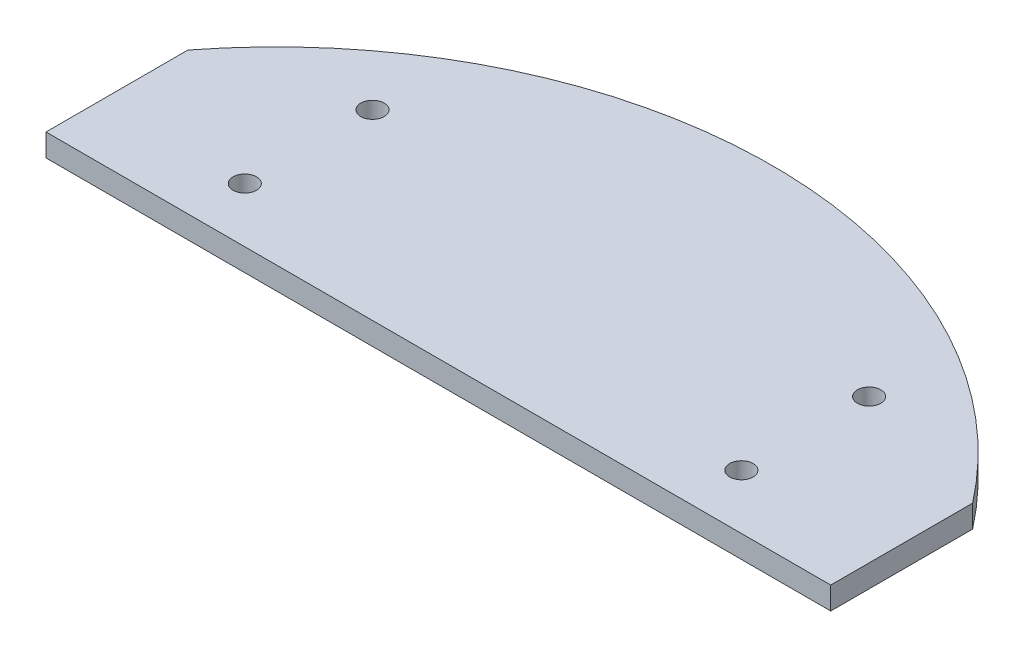
ISO-10303-21;
HEADER;
FILE_DESCRIPTION(('STEP AP214'),'2;1');
FILE_NAME('part.step','',(''),(''),'','','');
FILE_SCHEMA(('AUTOMOTIVE_DESIGN { 1 0 10303 214 1 1 1 1 }'));
ENDSEC;
DATA;
#1=APPLICATION_CONTEXT('core data for automotive mechanical design processes');
#2=APPLICATION_PROTOCOL_DEFINITION('international standard','automotive_design',2000,#1);
#3=PRODUCT_CONTEXT('',#1,'mechanical');
#4=PRODUCT('Part','Part','',(#3));
#5=PRODUCT_RELATED_PRODUCT_CATEGORY('part','',(#4));
#6=PRODUCT_DEFINITION_FORMATION('','',#4);
#7=PRODUCT_DEFINITION_CONTEXT('part definition',#1,'design');
#8=PRODUCT_DEFINITION('design','',#6,#7);
#9=PRODUCT_DEFINITION_SHAPE('','',#8);
#10=(LENGTH_UNIT() NAMED_UNIT(*) SI_UNIT(.MILLI.,.METRE.));
#11=(NAMED_UNIT(*) PLANE_ANGLE_UNIT() SI_UNIT($,.RADIAN.));
#12=(NAMED_UNIT(*) SI_UNIT($,.STERADIAN.) SOLID_ANGLE_UNIT());
#13=UNCERTAINTY_MEASURE_WITH_UNIT(LENGTH_MEASURE(1.E-05),#10,'distance_accuracy_value','');
#14=(GEOMETRIC_REPRESENTATION_CONTEXT(3) GLOBAL_UNCERTAINTY_ASSIGNED_CONTEXT((#13)) GLOBAL_UNIT_ASSIGNED_CONTEXT((#10,
#11,#12)) REPRESENTATION_CONTEXT('',''));
#15=CARTESIAN_POINT('',(0.,0.,0.));
#16=DIRECTION('',(0.,0.,1.));
#17=DIRECTION('',(1.,0.,0.));
#18=AXIS2_PLACEMENT_3D('',#15,#16,#17);
#19=CARTESIAN_POINT('',(0.,3.175,0.));
#20=DIRECTION('',(0.,1.,0.));
#21=DIRECTION('',(0.,0.,1.));
#22=AXIS2_PLACEMENT_3D('',#19,#20,#21);
#23=PLANE('',#22);
#24=CARTESIAN_POINT('',(-35.,3.175,-30.6217782649107));
#25=DIRECTION('',(0.,1.,0.));
#26=DIRECTION('',(0.,0.,-1.));
#27=AXIS2_PLACEMENT_3D('',#24,#25,#26);
#28=CIRCLE('',#27,1.65);
#29=CARTESIAN_POINT('',(-35.,3.175,-32.2717782649107));
#30=VERTEX_POINT('',#29);
#31=EDGE_CURVE('E120',#30,#30,#28,.T.);
#32=ORIENTED_EDGE('',*,*,#31,.F.);
#33=EDGE_LOOP('',(#32));
#34=FACE_BOUND('',#33,.T.);
#35=CARTESIAN_POINT('',(35.,3.175,-48.6217782649107));
#36=DIRECTION('',(0.,1.,0.));
#37=DIRECTION('',(0.,0.,1.));
#38=AXIS2_PLACEMENT_3D('',#35,#36,#37);
#39=CIRCLE('',#38,1.65);
#40=CARTESIAN_POINT('',(35.,3.175,-46.9717782649107));
#41=VERTEX_POINT('',#40);
#42=EDGE_CURVE('E99',#41,#41,#39,.T.);
#43=ORIENTED_EDGE('',*,*,#42,.F.);
#44=EDGE_LOOP('',(#43));
#45=FACE_BOUND('',#44,.T.);
#46=CARTESIAN_POINT('',(0.,3.175,0.));
#47=DIRECTION('',(0.,1.,0.));
#48=DIRECTION('',(0.,0.,1.));
#49=AXIS2_PLACEMENT_3D('',#46,#47,#48);
#50=CIRCLE('',#49,70.);
#51=CARTESIAN_POINT('',(55.3067347918631,3.175,-42.9087996413617));
#52=VERTEX_POINT('',#51);
#53=CARTESIAN_POINT('',(-55.3067347918631,3.175,-42.9087996413617));
#54=VERTEX_POINT('',#53);
#55=EDGE_CURVE('E84',#52,#54,#50,.T.);
#56=ORIENTED_EDGE('',*,*,#55,.T.);
#57=DIRECTION('',(0.,0.,1.));
#58=VECTOR('',#57,1.);
#59=CARTESIAN_POINT('',(-55.3067347918631,3.175,-42.9087996413617));
#60=LINE('',#59,#58);
#61=CARTESIAN_POINT('',(-55.3067347918631,3.175,-22.9087996413617));
#62=VERTEX_POINT('',#61);
#63=EDGE_CURVE('E79',#54,#62,#60,.T.);
#64=ORIENTED_EDGE('',*,*,#63,.T.);
#65=DIRECTION('',(1.,0.,0.));
#66=VECTOR('',#65,1.);
#67=CARTESIAN_POINT('',(-55.3067347918631,3.175,-22.9087996413617));
#68=LINE('',#67,#66);
#69=CARTESIAN_POINT('',(55.3067347918631,3.175,-22.9087996413617));
#70=VERTEX_POINT('',#69);
#71=EDGE_CURVE('E82',#62,#70,#68,.T.);
#72=ORIENTED_EDGE('',*,*,#71,.T.);
#73=DIRECTION('',(0.,0.,-1.));
#74=VECTOR('',#73,1.);
#75=CARTESIAN_POINT('',(55.3067347918631,3.175,-42.9087996413617));
#76=LINE('',#75,#74);
#77=EDGE_CURVE('E49',#70,#52,#76,.T.);
#78=ORIENTED_EDGE('',*,*,#77,.T.);
#79=EDGE_LOOP('',(#56,#64,#72,#78));
#80=FACE_BOUND('',#79,.T.);
#81=CARTESIAN_POINT('',(35.,3.175,-30.6217782649107));
#82=DIRECTION('',(0.,1.,0.));
#83=DIRECTION('',(0.,0.,1.));
#84=AXIS2_PLACEMENT_3D('',#81,#82,#83);
#85=CIRCLE('',#84,1.65);
#86=CARTESIAN_POINT('',(35.,3.175,-28.9717782649107));
#87=VERTEX_POINT('',#86);
#88=EDGE_CURVE('E114',#87,#87,#85,.T.);
#89=ORIENTED_EDGE('',*,*,#88,.F.);
#90=EDGE_LOOP('',(#89));
#91=FACE_BOUND('',#90,.T.);
#92=CARTESIAN_POINT('',(-35.,3.175,-48.6217782649107));
#93=DIRECTION('',(0.,1.,0.));
#94=DIRECTION('',(0.,0.,-1.));
#95=AXIS2_PLACEMENT_3D('',#92,#93,#94);
#96=CIRCLE('',#95,1.65);
#97=CARTESIAN_POINT('',(-35.,3.175,-50.2717782649107));
#98=VERTEX_POINT('',#97);
#99=EDGE_CURVE('E126',#98,#98,#96,.T.);
#100=ORIENTED_EDGE('',*,*,#99,.F.);
#101=EDGE_LOOP('',(#100));
#102=FACE_BOUND('',#101,.T.);
#103=ADVANCED_FACE('F32',(#34,#45,#80,#91,#102),#23,.T.);
#104=CARTESIAN_POINT('',(0.,0.,0.));
#105=DIRECTION('',(0.,1.,0.));
#106=DIRECTION('',(0.,0.,1.));
#107=AXIS2_PLACEMENT_3D('',#104,#105,#106);
#108=PLANE('',#107);
#109=CARTESIAN_POINT('',(0.,0.,0.));
#110=DIRECTION('',(0.,1.,0.));
#111=DIRECTION('',(0.,0.,1.));
#112=AXIS2_PLACEMENT_3D('',#109,#110,#111);
#113=CIRCLE('',#112,70.);
#114=CARTESIAN_POINT('',(55.3067347918631,0.,-42.9087996413617));
#115=VERTEX_POINT('',#114);
#116=CARTESIAN_POINT('',(-55.3067347918631,0.,-42.9087996413617));
#117=VERTEX_POINT('',#116);
#118=EDGE_CURVE('E96',#115,#117,#113,.T.);
#119=ORIENTED_EDGE('',*,*,#118,.F.);
#120=DIRECTION('',(0.,0.,-1.));
#121=VECTOR('',#120,1.);
#122=CARTESIAN_POINT('',(55.3067347918631,0.,-42.9087996413617));
#123=LINE('',#122,#121);
#124=CARTESIAN_POINT('',(55.3067347918631,0.,-22.9087996413617));
#125=VERTEX_POINT('',#124);
#126=EDGE_CURVE('E72',#125,#115,#123,.T.);
#127=ORIENTED_EDGE('',*,*,#126,.F.);
#128=DIRECTION('',(1.,0.,0.));
#129=VECTOR('',#128,1.);
#130=CARTESIAN_POINT('',(-55.3067347918631,0.,-22.9087996413617));
#131=LINE('',#130,#129);
#132=CARTESIAN_POINT('',(-55.3067347918631,0.,-22.9087996413617));
#133=VERTEX_POINT('',#132);
#134=EDGE_CURVE('E66',#133,#125,#131,.T.);
#135=ORIENTED_EDGE('',*,*,#134,.F.);
#136=DIRECTION('',(0.,0.,1.));
#137=VECTOR('',#136,1.);
#138=CARTESIAN_POINT('',(-55.3067347918631,0.,-42.9087996413617));
#139=LINE('',#138,#137);
#140=EDGE_CURVE('E88',#117,#133,#139,.T.);
#141=ORIENTED_EDGE('',*,*,#140,.F.);
#142=EDGE_LOOP('',(#119,#127,#135,#141));
#143=FACE_BOUND('',#142,.T.);
#144=CARTESIAN_POINT('',(35.,0.,-48.6217782649107));
#145=DIRECTION('',(0.,1.,0.));
#146=DIRECTION('',(0.,0.,1.));
#147=AXIS2_PLACEMENT_3D('',#144,#145,#146);
#148=CIRCLE('',#147,1.65);
#149=CARTESIAN_POINT('',(35.,0.,-46.9717782649107));
#150=VERTEX_POINT('',#149);
#151=EDGE_CURVE('E111',#150,#150,#148,.T.);
#152=ORIENTED_EDGE('',*,*,#151,.T.);
#153=EDGE_LOOP('',(#152));
#154=FACE_BOUND('',#153,.T.);
#155=CARTESIAN_POINT('',(35.,0.,-30.6217782649107));
#156=DIRECTION('',(0.,1.,0.));
#157=DIRECTION('',(0.,0.,1.));
#158=AXIS2_PLACEMENT_3D('',#155,#156,#157);
#159=CIRCLE('',#158,1.65);
#160=CARTESIAN_POINT('',(35.,0.,-28.9717782649107));
#161=VERTEX_POINT('',#160);
#162=EDGE_CURVE('E117',#161,#161,#159,.T.);
#163=ORIENTED_EDGE('',*,*,#162,.T.);
#164=EDGE_LOOP('',(#163));
#165=FACE_BOUND('',#164,.T.);
#166=CARTESIAN_POINT('',(-35.,0.,-30.6217782649107));
#167=DIRECTION('',(0.,1.,0.));
#168=DIRECTION('',(0.,0.,-1.));
#169=AXIS2_PLACEMENT_3D('',#166,#167,#168);
#170=CIRCLE('',#169,1.65);
#171=CARTESIAN_POINT('',(-35.,0.,-32.2717782649107));
#172=VERTEX_POINT('',#171);
#173=EDGE_CURVE('E123',#172,#172,#170,.T.);
#174=ORIENTED_EDGE('',*,*,#173,.T.);
#175=EDGE_LOOP('',(#174));
#176=FACE_BOUND('',#175,.T.);
#177=CARTESIAN_POINT('',(-35.,0.,-48.6217782649107));
#178=DIRECTION('',(0.,1.,0.));
#179=DIRECTION('',(0.,0.,-1.));
#180=AXIS2_PLACEMENT_3D('',#177,#178,#179);
#181=CIRCLE('',#180,1.65);
#182=CARTESIAN_POINT('',(-35.,0.,-50.2717782649107));
#183=VERTEX_POINT('',#182);
#184=EDGE_CURVE('E129',#183,#183,#181,.T.);
#185=ORIENTED_EDGE('',*,*,#184,.T.);
#186=EDGE_LOOP('',(#185));
#187=FACE_BOUND('',#186,.T.);
#188=ADVANCED_FACE('F107',(#143,#154,#165,#176,#187),#108,.F.);
#189=CARTESIAN_POINT('',(0.,3.175,0.));
#190=DIRECTION('',(0.,-1.,0.));
#191=DIRECTION('',(0.,0.,-1.));
#192=AXIS2_PLACEMENT_3D('',#189,#190,#191);
#193=CYLINDRICAL_SURFACE('',#192,70.);
#194=ORIENTED_EDGE('',*,*,#118,.T.);
#195=DIRECTION('',(0.,-1.,0.));
#196=VECTOR('',#195,1.);
#197=CARTESIAN_POINT('',(-55.3067347918631,3.175,-42.9087996413617));
#198=LINE('',#197,#196);
#199=EDGE_CURVE('E11',#54,#117,#198,.T.);
#200=ORIENTED_EDGE('',*,*,#199,.F.);
#201=ORIENTED_EDGE('',*,*,#55,.F.);
#202=DIRECTION('',(0.,-1.,0.));
#203=VECTOR('',#202,1.);
#204=CARTESIAN_POINT('',(55.3067347918631,3.175,-42.9087996413617));
#205=LINE('',#204,#203);
#206=EDGE_CURVE('E92',#52,#115,#205,.T.);
#207=ORIENTED_EDGE('',*,*,#206,.T.);
#208=EDGE_LOOP('',(#194,#200,#201,#207));
#209=FACE_BOUND('',#208,.T.);
#210=ADVANCED_FACE('F34',(#209),#193,.T.);
#211=CARTESIAN_POINT('',(-55.3067347918631,3.175,-42.9087996413617));
#212=DIRECTION('',(1.,0.,0.));
#213=DIRECTION('',(0.,0.,-1.));
#214=AXIS2_PLACEMENT_3D('',#211,#212,#213);
#215=PLANE('',#214);
#216=ORIENTED_EDGE('',*,*,#140,.T.);
#217=DIRECTION('',(0.,-1.,0.));
#218=VECTOR('',#217,1.);
#219=CARTESIAN_POINT('',(-55.3067347918631,3.175,-22.9087996413617));
#220=LINE('',#219,#218);
#221=EDGE_CURVE('E41',#62,#133,#220,.T.);
#222=ORIENTED_EDGE('',*,*,#221,.F.);
#223=ORIENTED_EDGE('',*,*,#63,.F.);
#224=ORIENTED_EDGE('',*,*,#199,.T.);
#225=EDGE_LOOP('',(#216,#222,#223,#224));
#226=FACE_BOUND('',#225,.T.);
#227=ADVANCED_FACE('F87',(#226),#215,.F.);
#228=CARTESIAN_POINT('',(-55.3067347918631,3.175,-22.9087996413617));
#229=DIRECTION('',(0.,0.,-1.));
#230=DIRECTION('',(-1.,0.,0.));
#231=AXIS2_PLACEMENT_3D('',#228,#229,#230);
#232=PLANE('',#231);
#233=ORIENTED_EDGE('',*,*,#134,.T.);
#234=DIRECTION('',(0.,-1.,0.));
#235=VECTOR('',#234,1.);
#236=CARTESIAN_POINT('',(55.3067347918631,3.175,-22.9087996413617));
#237=LINE('',#236,#235);
#238=EDGE_CURVE('E89',#70,#125,#237,.T.);
#239=ORIENTED_EDGE('',*,*,#238,.F.);
#240=ORIENTED_EDGE('',*,*,#71,.F.);
#241=ORIENTED_EDGE('',*,*,#221,.T.);
#242=EDGE_LOOP('',(#233,#239,#240,#241));
#243=FACE_BOUND('',#242,.T.);
#244=ADVANCED_FACE('F90',(#243),#232,.F.);
#245=CARTESIAN_POINT('',(55.3067347918631,3.175,-42.9087996413617));
#246=DIRECTION('',(-1.,0.,0.));
#247=DIRECTION('',(0.,0.,1.));
#248=AXIS2_PLACEMENT_3D('',#245,#246,#247);
#249=PLANE('',#248);
#250=ORIENTED_EDGE('',*,*,#126,.T.);
#251=ORIENTED_EDGE('',*,*,#206,.F.);
#252=ORIENTED_EDGE('',*,*,#77,.F.);
#253=ORIENTED_EDGE('',*,*,#238,.T.);
#254=EDGE_LOOP('',(#250,#251,#252,#253));
#255=FACE_BOUND('',#254,.T.);
#256=ADVANCED_FACE('F104',(#255),#249,.F.);
#257=CARTESIAN_POINT('',(35.,3.175,-48.6217782649107));
#258=DIRECTION('',(0.,-1.,0.));
#259=DIRECTION('',(0.,0.,-1.));
#260=AXIS2_PLACEMENT_3D('',#257,#258,#259);
#261=CYLINDRICAL_SURFACE('',#260,1.65);
#262=ORIENTED_EDGE('',*,*,#42,.T.);
#263=EDGE_LOOP('',(#262));
#264=FACE_BOUND('',#263,.T.);
#265=ORIENTED_EDGE('',*,*,#151,.F.);
#266=EDGE_LOOP('',(#265));
#267=FACE_BOUND('',#266,.T.);
#268=ADVANCED_FACE('F148',(#264,#267),#261,.F.);
#269=CARTESIAN_POINT('',(35.,3.175,-30.6217782649107));
#270=DIRECTION('',(0.,-1.,0.));
#271=DIRECTION('',(0.,0.,-1.));
#272=AXIS2_PLACEMENT_3D('',#269,#270,#271);
#273=CYLINDRICAL_SURFACE('',#272,1.65);
#274=ORIENTED_EDGE('',*,*,#88,.T.);
#275=EDGE_LOOP('',(#274));
#276=FACE_BOUND('',#275,.T.);
#277=ORIENTED_EDGE('',*,*,#162,.F.);
#278=EDGE_LOOP('',(#277));
#279=FACE_BOUND('',#278,.T.);
#280=ADVANCED_FACE('F200',(#276,#279),#273,.F.);
#281=CARTESIAN_POINT('',(-35.,3.175,-30.6217782649107));
#282=DIRECTION('',(0.,-1.,0.));
#283=DIRECTION('',(0.,0.,-1.));
#284=AXIS2_PLACEMENT_3D('',#281,#282,#283);
#285=CYLINDRICAL_SURFACE('',#284,1.65);
#286=ORIENTED_EDGE('',*,*,#31,.T.);
#287=EDGE_LOOP('',(#286));
#288=FACE_BOUND('',#287,.T.);
#289=ORIENTED_EDGE('',*,*,#173,.F.);
#290=EDGE_LOOP('',(#289));
#291=FACE_BOUND('',#290,.T.);
#292=ADVANCED_FACE('F208',(#288,#291),#285,.F.);
#293=CARTESIAN_POINT('',(-35.,3.175,-48.6217782649107));
#294=DIRECTION('',(0.,-1.,0.));
#295=DIRECTION('',(0.,0.,-1.));
#296=AXIS2_PLACEMENT_3D('',#293,#294,#295);
#297=CYLINDRICAL_SURFACE('',#296,1.65);
#298=ORIENTED_EDGE('',*,*,#99,.T.);
#299=EDGE_LOOP('',(#298));
#300=FACE_BOUND('',#299,.T.);
#301=ORIENTED_EDGE('',*,*,#184,.F.);
#302=EDGE_LOOP('',(#301));
#303=FACE_BOUND('',#302,.T.);
#304=ADVANCED_FACE('F135',(#300,#303),#297,.F.);
#305=CLOSED_SHELL('',(#103,#188,#210,#227,#244,#256,#268,#280,#292,#304));
#306=MANIFOLD_SOLID_BREP('B2',#305);
#307=ADVANCED_BREP_SHAPE_REPRESENTATION('',(#18,#306),#14);
#308=SHAPE_DEFINITION_REPRESENTATION(#9,#307);
ENDSEC;
END-ISO-10303-21;
